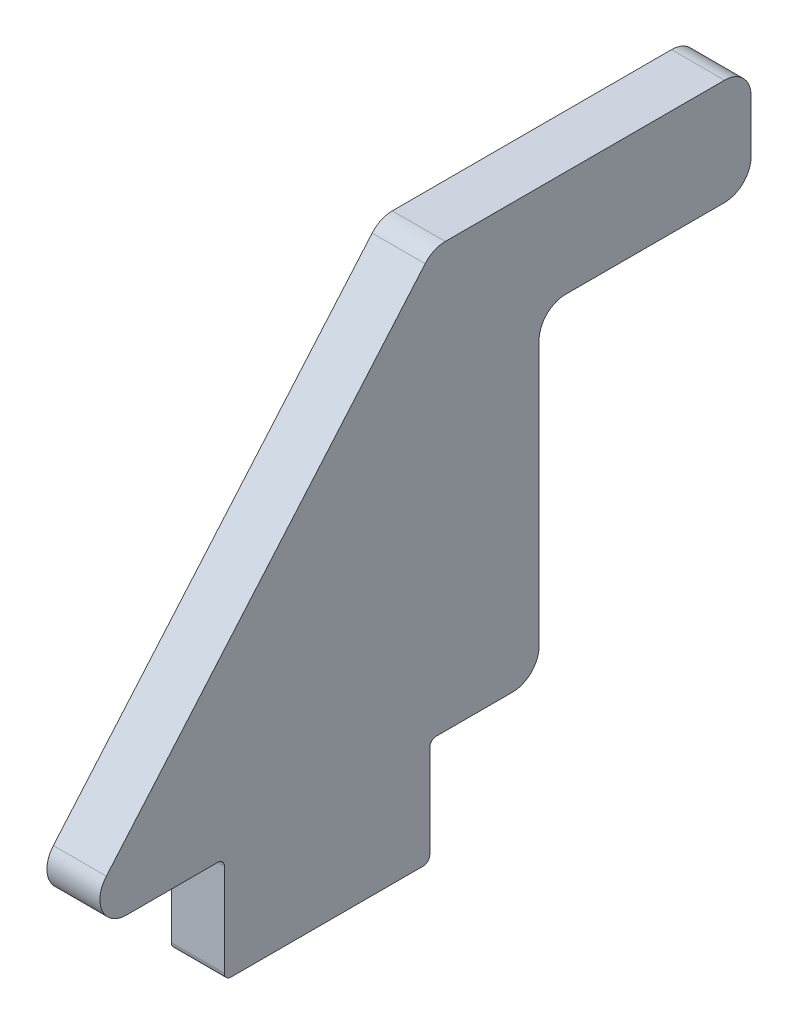
ISO-10303-21;
HEADER;
FILE_DESCRIPTION(('STEP AP214'),'2;1');
FILE_NAME('part.step','',(''),(''),'','','');
FILE_SCHEMA(('AUTOMOTIVE_DESIGN { 1 0 10303 214 1 1 1 1 }'));
ENDSEC;
DATA;
#1=APPLICATION_CONTEXT('core data for automotive mechanical design processes');
#2=APPLICATION_PROTOCOL_DEFINITION('international standard','automotive_design',2000,#1);
#3=PRODUCT_CONTEXT('',#1,'mechanical');
#4=PRODUCT('Part','Part','',(#3));
#5=PRODUCT_RELATED_PRODUCT_CATEGORY('part','',(#4));
#6=PRODUCT_DEFINITION_FORMATION('','',#4);
#7=PRODUCT_DEFINITION_CONTEXT('part definition',#1,'design');
#8=PRODUCT_DEFINITION('design','',#6,#7);
#9=PRODUCT_DEFINITION_SHAPE('','',#8);
#10=(LENGTH_UNIT() NAMED_UNIT(*) SI_UNIT(.MILLI.,.METRE.));
#11=(NAMED_UNIT(*) PLANE_ANGLE_UNIT() SI_UNIT($,.RADIAN.));
#12=(NAMED_UNIT(*) SI_UNIT($,.STERADIAN.) SOLID_ANGLE_UNIT());
#13=UNCERTAINTY_MEASURE_WITH_UNIT(LENGTH_MEASURE(1.E-05),#10,'distance_accuracy_value','');
#14=(GEOMETRIC_REPRESENTATION_CONTEXT(3) GLOBAL_UNCERTAINTY_ASSIGNED_CONTEXT((#13)) GLOBAL_UNIT_ASSIGNED_CONTEXT((#10,
#11,#12)) REPRESENTATION_CONTEXT('',''));
#15=CARTESIAN_POINT('',(0.,0.,0.));
#16=DIRECTION('',(0.,0.,1.));
#17=DIRECTION('',(1.,0.,0.));
#18=AXIS2_PLACEMENT_3D('',#15,#16,#17);
#19=CARTESIAN_POINT('',(-6.35,0.,37.703125));
#20=DIRECTION('',(0.,-1.,0.));
#21=DIRECTION('',(0.,0.,-1.));
#22=AXIS2_PLACEMENT_3D('',#19,#20,#21);
#23=PLANE('',#22);
#24=DIRECTION('',(0.,0.,-1.));
#25=VECTOR('',#24,1.);
#26=CARTESIAN_POINT('',(-6.35,0.,37.703125));
#27=LINE('',#26,#25);
#28=CARTESIAN_POINT('',(-6.35,0.,49.4413967732448));
#29=VERTEX_POINT('',#28);
#30=CARTESIAN_POINT('',(-6.35,0.,38.496875));
#31=VERTEX_POINT('',#30);
#32=EDGE_CURVE('E464',#29,#31,#27,.T.);
#33=ORIENTED_EDGE('',*,*,#32,.T.);
#34=DIRECTION('',(1.,0.,0.));
#35=VECTOR('',#34,1.);
#36=CARTESIAN_POINT('',(0.,0.,38.496875));
#37=LINE('',#36,#35);
#38=CARTESIAN_POINT('',(0.,0.,38.496875));
#39=VERTEX_POINT('',#38);
#40=EDGE_CURVE('E328',#31,#39,#37,.T.);
#41=ORIENTED_EDGE('',*,*,#40,.T.);
#42=DIRECTION('',(0.,0.,-1.));
#43=VECTOR('',#42,1.);
#44=CARTESIAN_POINT('',(0.,0.,37.703125));
#45=LINE('',#44,#43);
#46=CARTESIAN_POINT('',(0.,0.,49.4413967732448));
#47=VERTEX_POINT('',#46);
#48=EDGE_CURVE('E416',#47,#39,#45,.T.);
#49=ORIENTED_EDGE('',*,*,#48,.F.);
#50=DIRECTION('',(1.,0.,0.));
#51=VECTOR('',#50,1.);
#52=CARTESIAN_POINT('',(-6.35,0.,49.4413967732448));
#53=LINE('',#52,#51);
#54=EDGE_CURVE('E320',#47,#29,#53,.F.);
#55=ORIENTED_EDGE('',*,*,#54,.T.);
#56=EDGE_LOOP('',(#33,#41,#49,#55));
#57=FACE_BOUND('',#56,.T.);
#58=ADVANCED_FACE('F53',(#57),#23,.T.);
#59=CARTESIAN_POINT('',(-6.35,0.,56.35625));
#60=DIRECTION('',(0.,0.651766743287986,0.758419483098748));
#61=DIRECTION('',(0.,-0.758419483098748,0.651766743287986));
#62=AXIS2_PLACEMENT_3D('',#59,#60,#61);
#63=PLANE('',#62);
#64=DIRECTION('',(0.,-0.758419483098748,0.651766743287986));
#65=VECTOR('',#64,1.);
#66=CARTESIAN_POINT('',(0.,0.,56.35625));
#67=LINE('',#66,#65);
#68=CARTESIAN_POINT('',(0.,49.6943594099394,13.6501598820834));
#69=VERTEX_POINT('',#68);
#70=CARTESIAN_POINT('',(0.,5.24435940993935,51.8493786320834));
#71=VERTEX_POINT('',#70);
#72=EDGE_CURVE('E259',#69,#71,#67,.T.);
#73=ORIENTED_EDGE('',*,*,#72,.F.);
#74=DIRECTION('',(1.,0.,0.));
#75=VECTOR('',#74,1.);
#76=CARTESIAN_POINT('',(-6.35,49.6943594099394,13.6501598820834));
#77=LINE('',#76,#75);
#78=CARTESIAN_POINT('',(-6.35,49.6943594099394,13.6501598820834));
#79=VERTEX_POINT('',#78);
#80=EDGE_CURVE('E286',#69,#79,#77,.F.);
#81=ORIENTED_EDGE('',*,*,#80,.T.);
#82=DIRECTION('',(0.,-0.758419483098748,0.651766743287986));
#83=VECTOR('',#82,1.);
#84=CARTESIAN_POINT('',(-6.35,0.,56.35625));
#85=LINE('',#84,#83);
#86=CARTESIAN_POINT('',(-6.35,5.24435940993935,51.8493786320834));
#87=VERTEX_POINT('',#86);
#88=EDGE_CURVE('E264',#79,#87,#85,.T.);
#89=ORIENTED_EDGE('',*,*,#88,.T.);
#90=DIRECTION('',(1.,0.,0.));
#91=VECTOR('',#90,1.);
#92=CARTESIAN_POINT('',(-6.35,5.24435940993935,51.8493786320834));
#93=LINE('',#92,#91);
#94=EDGE_CURVE('E283',#87,#71,#93,.T.);
#95=ORIENTED_EDGE('',*,*,#94,.T.);
#96=EDGE_LOOP('',(#73,#81,#89,#95));
#97=FACE_BOUND('',#96,.T.);
#98=ADVANCED_FACE('F486',(#97),#63,.T.);
#99=CARTESIAN_POINT('',(-6.35,50.8,12.7));
#100=DIRECTION('',(0.,1.,0.));
#101=DIRECTION('',(0.,0.,1.));
#102=AXIS2_PLACEMENT_3D('',#99,#100,#101);
#103=PLANE('',#102);
#104=DIRECTION('',(0.,0.,1.));
#105=VECTOR('',#104,1.);
#106=CARTESIAN_POINT('',(-6.35,50.8,12.7));
#107=LINE('',#106,#105);
#108=CARTESIAN_POINT('',(-6.35,50.8,-22.225));
#109=VERTEX_POINT('',#108);
#110=CARTESIAN_POINT('',(-6.35,50.8,11.2421780232448));
#111=VERTEX_POINT('',#110);
#112=EDGE_CURVE('E269',#109,#111,#107,.T.);
#113=ORIENTED_EDGE('',*,*,#112,.T.);
#114=DIRECTION('',(1.,0.,0.));
#115=VECTOR('',#114,1.);
#116=CARTESIAN_POINT('',(-6.35,50.8,11.2421780232448));
#117=LINE('',#116,#115);
#118=CARTESIAN_POINT('',(0.,50.8,11.2421780232448));
#119=VERTEX_POINT('',#118);
#120=EDGE_CURVE('E257',#111,#119,#117,.T.);
#121=ORIENTED_EDGE('',*,*,#120,.T.);
#122=DIRECTION('',(0.,0.,1.));
#123=VECTOR('',#122,1.);
#124=CARTESIAN_POINT('',(0.,50.8,12.7));
#125=LINE('',#124,#123);
#126=CARTESIAN_POINT('',(0.,50.8,-22.225));
#127=VERTEX_POINT('',#126);
#128=EDGE_CURVE('E239',#127,#119,#125,.T.);
#129=ORIENTED_EDGE('',*,*,#128,.F.);
#130=DIRECTION('',(1.,0.,0.));
#131=VECTOR('',#130,1.);
#132=CARTESIAN_POINT('',(-6.35,50.8,-22.225));
#133=LINE('',#132,#131);
#134=EDGE_CURVE('E254',#127,#109,#133,.F.);
#135=ORIENTED_EDGE('',*,*,#134,.T.);
#136=EDGE_LOOP('',(#113,#121,#129,#135));
#137=FACE_BOUND('',#136,.T.);
#138=ADVANCED_FACE('F253',(#137),#103,.T.);
#139=CARTESIAN_POINT('',(-6.35,50.8,-25.4));
#140=DIRECTION('',(0.,0.,-1.));
#141=DIRECTION('',(-1.,0.,0.));
#142=AXIS2_PLACEMENT_3D('',#139,#140,#141);
#143=PLANE('',#142);
#144=DIRECTION('',(0.,1.,0.));
#145=VECTOR('',#144,1.);
#146=CARTESIAN_POINT('',(0.,50.8,-25.4));
#147=LINE('',#146,#145);
#148=CARTESIAN_POINT('',(0.,41.275,-25.4));
#149=VERTEX_POINT('',#148);
#150=CARTESIAN_POINT('',(0.,47.625,-25.4));
#151=VERTEX_POINT('',#150);
#152=EDGE_CURVE('E241',#149,#151,#147,.T.);
#153=ORIENTED_EDGE('',*,*,#152,.F.);
#154=DIRECTION('',(1.,0.,0.));
#155=VECTOR('',#154,1.);
#156=CARTESIAN_POINT('',(-6.35,41.275,-25.4));
#157=LINE('',#156,#155);
#158=CARTESIAN_POINT('',(-6.35,41.275,-25.4));
#159=VERTEX_POINT('',#158);
#160=EDGE_CURVE('E318',#149,#159,#157,.F.);
#161=ORIENTED_EDGE('',*,*,#160,.T.);
#162=DIRECTION('',(0.,1.,0.));
#163=VECTOR('',#162,1.);
#164=CARTESIAN_POINT('',(-6.35,50.8,-25.4));
#165=LINE('',#164,#163);
#166=CARTESIAN_POINT('',(-6.35,47.625,-25.4));
#167=VERTEX_POINT('',#166);
#168=EDGE_CURVE('E410',#159,#167,#165,.T.);
#169=ORIENTED_EDGE('',*,*,#168,.T.);
#170=DIRECTION('',(1.,0.,0.));
#171=VECTOR('',#170,1.);
#172=CARTESIAN_POINT('',(-6.35,47.625,-25.4));
#173=LINE('',#172,#171);
#174=EDGE_CURVE('E316',#167,#151,#173,.T.);
#175=ORIENTED_EDGE('',*,*,#174,.T.);
#176=EDGE_LOOP('',(#153,#161,#169,#175));
#177=FACE_BOUND('',#176,.T.);
#178=ADVANCED_FACE('F686',(#177),#143,.T.);
#179=CARTESIAN_POINT('',(-6.35,38.1,-25.4));
#180=DIRECTION('',(0.,-1.,0.));
#181=DIRECTION('',(0.,0.,-1.));
#182=AXIS2_PLACEMENT_3D('',#179,#180,#181);
#183=PLANE('',#182);
#184=DIRECTION('',(0.,0.,-1.));
#185=VECTOR('',#184,1.);
#186=CARTESIAN_POINT('',(0.,38.1,-25.4));
#187=LINE('',#186,#185);
#188=CARTESIAN_POINT('',(0.,38.1,-3.175));
#189=VERTEX_POINT('',#188);
#190=CARTESIAN_POINT('',(0.,38.1,-22.225));
#191=VERTEX_POINT('',#190);
#192=EDGE_CURVE('E431',#189,#191,#187,.T.);
#193=ORIENTED_EDGE('',*,*,#192,.F.);
#194=DIRECTION('',(1.,0.,0.));
#195=VECTOR('',#194,1.);
#196=CARTESIAN_POINT('',(-6.35,38.1,-3.17500000000001));
#197=LINE('',#196,#195);
#198=CARTESIAN_POINT('',(-6.35,38.1,-3.175));
#199=VERTEX_POINT('',#198);
#200=EDGE_CURVE('E314',#189,#199,#197,.F.);
#201=ORIENTED_EDGE('',*,*,#200,.T.);
#202=DIRECTION('',(0.,0.,-1.));
#203=VECTOR('',#202,1.);
#204=CARTESIAN_POINT('',(-6.35,38.1,-25.4));
#205=LINE('',#204,#203);
#206=CARTESIAN_POINT('',(-6.35,38.1,-22.225));
#207=VERTEX_POINT('',#206);
#208=EDGE_CURVE('E406',#199,#207,#205,.T.);
#209=ORIENTED_EDGE('',*,*,#208,.T.);
#210=DIRECTION('',(1.,0.,0.));
#211=VECTOR('',#210,1.);
#212=CARTESIAN_POINT('',(-6.35,38.1,-22.225));
#213=LINE('',#212,#211);
#214=EDGE_CURVE('E311',#207,#191,#213,.T.);
#215=ORIENTED_EDGE('',*,*,#214,.T.);
#216=EDGE_LOOP('',(#193,#201,#209,#215));
#217=FACE_BOUND('',#216,.T.);
#218=ADVANCED_FACE('F675',(#217),#183,.T.);
#219=CARTESIAN_POINT('',(-6.35,38.1,0.));
#220=DIRECTION('',(0.,0.,-1.));
#221=DIRECTION('',(0.,1.,0.));
#222=AXIS2_PLACEMENT_3D('',#219,#220,#221);
#223=PLANE('',#222);
#224=DIRECTION('',(0.,1.,0.));
#225=VECTOR('',#224,1.);
#226=CARTESIAN_POINT('',(0.,38.1,0.));
#227=LINE('',#226,#225);
#228=CARTESIAN_POINT('',(0.,3.175,0.));
#229=VERTEX_POINT('',#228);
#230=CARTESIAN_POINT('',(0.,34.925,0.));
#231=VERTEX_POINT('',#230);
#232=EDGE_CURVE('E380',#229,#231,#227,.T.);
#233=ORIENTED_EDGE('',*,*,#232,.F.);
#234=DIRECTION('',(1.,0.,0.));
#235=VECTOR('',#234,1.);
#236=CARTESIAN_POINT('',(-6.35,3.175,0.));
#237=LINE('',#236,#235);
#238=CARTESIAN_POINT('',(-6.35,3.175,0.));
#239=VERTEX_POINT('',#238);
#240=EDGE_CURVE('E309',#229,#239,#237,.F.);
#241=ORIENTED_EDGE('',*,*,#240,.T.);
#242=DIRECTION('',(0.,1.,0.));
#243=VECTOR('',#242,1.);
#244=CARTESIAN_POINT('',(-6.35,38.1,0.));
#245=LINE('',#244,#243);
#246=CARTESIAN_POINT('',(-6.35,34.925,0.));
#247=VERTEX_POINT('',#246);
#248=EDGE_CURVE('E396',#239,#247,#245,.T.);
#249=ORIENTED_EDGE('',*,*,#248,.T.);
#250=DIRECTION('',(1.,0.,0.));
#251=VECTOR('',#250,1.);
#252=CARTESIAN_POINT('',(0.,34.925,0.));
#253=LINE('',#252,#251);
#254=EDGE_CURVE('E306',#247,#231,#253,.T.);
#255=ORIENTED_EDGE('',*,*,#254,.T.);
#256=EDGE_LOOP('',(#233,#241,#249,#255));
#257=FACE_BOUND('',#256,.T.);
#258=ADVANCED_FACE('F575',(#257),#223,.T.);
#259=CARTESIAN_POINT('',(-6.35,0.,0.));
#260=DIRECTION('',(0.,-1.,0.));
#261=DIRECTION('',(0.,0.,-1.));
#262=AXIS2_PLACEMENT_3D('',#259,#260,#261);
#263=PLANE('',#262);
#264=DIRECTION('',(0.,0.,-1.));
#265=VECTOR('',#264,1.);
#266=CARTESIAN_POINT('',(0.,0.,0.));
#267=LINE('',#266,#265);
#268=CARTESIAN_POINT('',(0.,0.,12.303125));
#269=VERTEX_POINT('',#268);
#270=CARTESIAN_POINT('',(0.,0.,3.175));
#271=VERTEX_POINT('',#270);
#272=EDGE_CURVE('E368',#269,#271,#267,.T.);
#273=ORIENTED_EDGE('',*,*,#272,.F.);
#274=DIRECTION('',(1.,0.,0.));
#275=VECTOR('',#274,1.);
#276=CARTESIAN_POINT('',(-6.35,0.,12.303125));
#277=LINE('',#276,#275);
#278=CARTESIAN_POINT('',(-6.35,0.,12.303125));
#279=VERTEX_POINT('',#278);
#280=EDGE_CURVE('E341',#269,#279,#277,.F.);
#281=ORIENTED_EDGE('',*,*,#280,.T.);
#282=DIRECTION('',(0.,0.,-1.));
#283=VECTOR('',#282,1.);
#284=CARTESIAN_POINT('',(-6.35,0.,0.));
#285=LINE('',#284,#283);
#286=CARTESIAN_POINT('',(-6.35,0.,3.175));
#287=VERTEX_POINT('',#286);
#288=EDGE_CURVE('E387',#279,#287,#285,.T.);
#289=ORIENTED_EDGE('',*,*,#288,.T.);
#290=DIRECTION('',(1.,0.,0.));
#291=VECTOR('',#290,1.);
#292=CARTESIAN_POINT('',(-6.35,0.,3.175));
#293=LINE('',#292,#291);
#294=EDGE_CURVE('E303',#287,#271,#293,.T.);
#295=ORIENTED_EDGE('',*,*,#294,.T.);
#296=EDGE_LOOP('',(#273,#281,#289,#295));
#297=FACE_BOUND('',#296,.T.);
#298=ADVANCED_FACE('F376',(#297),#263,.T.);
#299=CARTESIAN_POINT('',(-6.35,0.,13.096875));
#300=DIRECTION('',(0.,0.,-1.));
#301=DIRECTION('',(0.,1.,0.));
#302=AXIS2_PLACEMENT_3D('',#299,#300,#301);
#303=PLANE('',#302);
#304=DIRECTION('',(0.,1.,0.));
#305=VECTOR('',#304,1.);
#306=CARTESIAN_POINT('',(-6.35,0.,13.096875));
#307=LINE('',#306,#305);
#308=CARTESIAN_POINT('',(-6.35,-11.90625,13.096875));
#309=VERTEX_POINT('',#308);
#310=CARTESIAN_POINT('',(-6.35,-0.793750000000002,13.096875));
#311=VERTEX_POINT('',#310);
#312=EDGE_CURVE('E386',#309,#311,#307,.T.);
#313=ORIENTED_EDGE('',*,*,#312,.T.);
#314=DIRECTION('',(1.,0.,0.));
#315=VECTOR('',#314,1.);
#316=CARTESIAN_POINT('',(0.,-0.793750000000002,13.096875));
#317=LINE('',#316,#315);
#318=CARTESIAN_POINT('',(0.,-0.793750000000002,13.096875));
#319=VERTEX_POINT('',#318);
#320=EDGE_CURVE('E338',#311,#319,#317,.T.);
#321=ORIENTED_EDGE('',*,*,#320,.T.);
#322=DIRECTION('',(0.,1.,0.));
#323=VECTOR('',#322,1.);
#324=CARTESIAN_POINT('',(0.,0.,13.096875));
#325=LINE('',#324,#323);
#326=CARTESIAN_POINT('',(0.,-11.90625,13.096875));
#327=VERTEX_POINT('',#326);
#328=EDGE_CURVE('E371',#327,#319,#325,.T.);
#329=ORIENTED_EDGE('',*,*,#328,.F.);
#330=DIRECTION('',(1.,0.,0.));
#331=VECTOR('',#330,1.);
#332=CARTESIAN_POINT('',(-6.35,-11.90625,13.096875));
#333=LINE('',#332,#331);
#334=EDGE_CURVE('E336',#327,#309,#333,.F.);
#335=ORIENTED_EDGE('',*,*,#334,.T.);
#336=EDGE_LOOP('',(#313,#321,#329,#335));
#337=FACE_BOUND('',#336,.T.);
#338=ADVANCED_FACE('F389',(#337),#303,.T.);
#339=CARTESIAN_POINT('',(-6.35,-12.7,13.096875));
#340=DIRECTION('',(0.,-1.,0.));
#341=DIRECTION('',(0.,0.,-1.));
#342=AXIS2_PLACEMENT_3D('',#339,#340,#341);
#343=PLANE('',#342);
#344=DIRECTION('',(0.,0.,-1.));
#345=VECTOR('',#344,1.);
#346=CARTESIAN_POINT('',(-6.35,-12.7,13.096875));
#347=LINE('',#346,#345);
#348=CARTESIAN_POINT('',(-6.35,-12.7,36.909375));
#349=VERTEX_POINT('',#348);
#350=CARTESIAN_POINT('',(-6.35,-12.7,13.890625));
#351=VERTEX_POINT('',#350);
#352=EDGE_CURVE('E391',#349,#351,#347,.T.);
#353=ORIENTED_EDGE('',*,*,#352,.T.);
#354=DIRECTION('',(1.,0.,0.));
#355=VECTOR('',#354,1.);
#356=CARTESIAN_POINT('',(-6.35,-12.7,13.890625));
#357=LINE('',#356,#355);
#358=CARTESIAN_POINT('',(0.,-12.7,13.890625));
#359=VERTEX_POINT('',#358);
#360=EDGE_CURVE('E344',#351,#359,#357,.T.);
#361=ORIENTED_EDGE('',*,*,#360,.T.);
#362=DIRECTION('',(0.,0.,-1.));
#363=VECTOR('',#362,1.);
#364=CARTESIAN_POINT('',(0.,-12.7,13.096875));
#365=LINE('',#364,#363);
#366=CARTESIAN_POINT('',(0.,-12.7,36.909375));
#367=VERTEX_POINT('',#366);
#368=EDGE_CURVE('E424',#367,#359,#365,.T.);
#369=ORIENTED_EDGE('',*,*,#368,.F.);
#370=DIRECTION('',(1.,0.,0.));
#371=VECTOR('',#370,1.);
#372=CARTESIAN_POINT('',(-6.35,-12.7,36.909375));
#373=LINE('',#372,#371);
#374=EDGE_CURVE('E82',#367,#349,#373,.F.);
#375=ORIENTED_EDGE('',*,*,#374,.T.);
#376=EDGE_LOOP('',(#353,#361,#369,#375));
#377=FACE_BOUND('',#376,.T.);
#378=ADVANCED_FACE('F510',(#377),#343,.T.);
#379=CARTESIAN_POINT('',(-6.35,-12.7,37.703125));
#380=DIRECTION('',(0.,0.,1.));
#381=DIRECTION('',(1.,0.,0.));
#382=AXIS2_PLACEMENT_3D('',#379,#380,#381);
#383=PLANE('',#382);
#384=DIRECTION('',(0.,-1.,0.));
#385=VECTOR('',#384,1.);
#386=CARTESIAN_POINT('',(0.,-12.7,37.703125));
#387=LINE('',#386,#385);
#388=CARTESIAN_POINT('',(0.,-0.793750000000005,37.703125));
#389=VERTEX_POINT('',#388);
#390=CARTESIAN_POINT('',(0.,-11.90625,37.703125));
#391=VERTEX_POINT('',#390);
#392=EDGE_CURVE('E420',#389,#391,#387,.T.);
#393=ORIENTED_EDGE('',*,*,#392,.F.);
#394=DIRECTION('',(1.,0.,0.));
#395=VECTOR('',#394,1.);
#396=CARTESIAN_POINT('',(-6.35,-0.793750000000005,37.703125));
#397=LINE('',#396,#395);
#398=CARTESIAN_POINT('',(-6.35,-0.793750000000005,37.703125));
#399=VERTEX_POINT('',#398);
#400=EDGE_CURVE('E334',#389,#399,#397,.F.);
#401=ORIENTED_EDGE('',*,*,#400,.T.);
#402=DIRECTION('',(0.,-1.,0.));
#403=VECTOR('',#402,1.);
#404=CARTESIAN_POINT('',(-6.35,-12.7,37.703125));
#405=LINE('',#404,#403);
#406=CARTESIAN_POINT('',(-6.35,-11.90625,37.703125));
#407=VERTEX_POINT('',#406);
#408=EDGE_CURVE('E399',#399,#407,#405,.T.);
#409=ORIENTED_EDGE('',*,*,#408,.T.);
#410=DIRECTION('',(1.,0.,0.));
#411=VECTOR('',#410,1.);
#412=CARTESIAN_POINT('',(-6.35,-11.90625,37.703125));
#413=LINE('',#412,#411);
#414=EDGE_CURVE('E331',#407,#391,#413,.T.);
#415=ORIENTED_EDGE('',*,*,#414,.T.);
#416=EDGE_LOOP('',(#393,#401,#409,#415));
#417=FACE_BOUND('',#416,.T.);
#418=ADVANCED_FACE('F506',(#417),#383,.T.);
#419=CARTESIAN_POINT('',(-6.35,0.,0.));
#420=DIRECTION('',(1.,0.,0.));
#421=DIRECTION('',(0.,0.,-1.));
#422=AXIS2_PLACEMENT_3D('',#419,#420,#421);
#423=PLANE('',#422);
#424=ORIENTED_EDGE('',*,*,#312,.F.);
#425=CARTESIAN_POINT('',(-6.35,-11.90625,13.890625));
#426=DIRECTION('',(1.,0.,0.));
#427=DIRECTION('',(0.,0.,-1.));
#428=AXIS2_PLACEMENT_3D('',#425,#426,#427);
#429=CIRCLE('',#428,0.79375);
#430=EDGE_CURVE('E73',#309,#351,#429,.F.);
#431=ORIENTED_EDGE('',*,*,#430,.T.);
#432=ORIENTED_EDGE('',*,*,#352,.F.);
#433=CARTESIAN_POINT('',(-6.35,-11.90625,36.909375));
#434=DIRECTION('',(1.,0.,0.));
#435=DIRECTION('',(0.,0.,-1.));
#436=AXIS2_PLACEMENT_3D('',#433,#434,#435);
#437=CIRCLE('',#436,0.79375);
#438=EDGE_CURVE('E353',#349,#407,#437,.F.);
#439=ORIENTED_EDGE('',*,*,#438,.T.);
#440=ORIENTED_EDGE('',*,*,#408,.F.);
#441=CARTESIAN_POINT('',(-6.35,-0.793750000000005,38.496875));
#442=DIRECTION('',(1.,0.,0.));
#443=DIRECTION('',(0.,0.,-1.));
#444=AXIS2_PLACEMENT_3D('',#441,#442,#443);
#445=CIRCLE('',#444,0.79375);
#446=EDGE_CURVE('E361',#399,#31,#445,.T.);
#447=ORIENTED_EDGE('',*,*,#446,.T.);
#448=ORIENTED_EDGE('',*,*,#32,.F.);
#449=CARTESIAN_POINT('',(-6.35,3.17499999999999,49.4413967732448));
#450=DIRECTION('',(1.,0.,0.));
#451=DIRECTION('',(0.,0.,-1.));
#452=AXIS2_PLACEMENT_3D('',#449,#450,#451);
#453=CIRCLE('',#452,3.175);
#454=EDGE_CURVE('E288',#29,#87,#453,.F.);
#455=ORIENTED_EDGE('',*,*,#454,.T.);
#456=ORIENTED_EDGE('',*,*,#88,.F.);
#457=CARTESIAN_POINT('',(-6.35,47.625,11.2421780232448));
#458=DIRECTION('',(1.,0.,0.));
#459=DIRECTION('',(0.,0.,-1.));
#460=AXIS2_PLACEMENT_3D('',#457,#458,#459);
#461=CIRCLE('',#460,3.175);
#462=EDGE_CURVE('E300',#79,#111,#461,.F.);
#463=ORIENTED_EDGE('',*,*,#462,.T.);
#464=ORIENTED_EDGE('',*,*,#112,.F.);
#465=CARTESIAN_POINT('',(-6.35,47.625,-22.225));
#466=DIRECTION('',(1.,0.,0.));
#467=DIRECTION('',(0.,0.,-1.));
#468=AXIS2_PLACEMENT_3D('',#465,#466,#467);
#469=CIRCLE('',#468,3.175);
#470=EDGE_CURVE('E263',#109,#167,#469,.F.);
#471=ORIENTED_EDGE('',*,*,#470,.T.);
#472=ORIENTED_EDGE('',*,*,#168,.F.);
#473=CARTESIAN_POINT('',(-6.35,41.275,-22.225));
#474=DIRECTION('',(1.,0.,0.));
#475=DIRECTION('',(0.,0.,-1.));
#476=AXIS2_PLACEMENT_3D('',#473,#474,#475);
#477=CIRCLE('',#476,3.175);
#478=EDGE_CURVE('E293',#159,#207,#477,.F.);
#479=ORIENTED_EDGE('',*,*,#478,.T.);
#480=ORIENTED_EDGE('',*,*,#208,.F.);
#481=CARTESIAN_POINT('',(-6.35,34.925,-3.17500000000001));
#482=DIRECTION('',(1.,0.,0.));
#483=DIRECTION('',(0.,0.,-1.));
#484=AXIS2_PLACEMENT_3D('',#481,#482,#483);
#485=CIRCLE('',#484,3.175);
#486=EDGE_CURVE('E325',#199,#247,#485,.T.);
#487=ORIENTED_EDGE('',*,*,#486,.T.);
#488=ORIENTED_EDGE('',*,*,#248,.F.);
#489=CARTESIAN_POINT('',(-6.35,3.175,3.175));
#490=DIRECTION('',(1.,0.,0.));
#491=DIRECTION('',(0.,0.,-1.));
#492=AXIS2_PLACEMENT_3D('',#489,#490,#491);
#493=CIRCLE('',#492,3.175);
#494=EDGE_CURVE('E296',#239,#287,#493,.F.);
#495=ORIENTED_EDGE('',*,*,#494,.T.);
#496=ORIENTED_EDGE('',*,*,#288,.F.);
#497=CARTESIAN_POINT('',(-6.35,-0.793750000000002,12.303125));
#498=DIRECTION('',(1.,0.,0.));
#499=DIRECTION('',(0.,0.,-1.));
#500=AXIS2_PLACEMENT_3D('',#497,#498,#499);
#501=CIRCLE('',#500,0.79375);
#502=EDGE_CURVE('E11',#279,#311,#501,.T.);
#503=ORIENTED_EDGE('',*,*,#502,.T.);
#504=EDGE_LOOP('',(#424,#431,#432,#439,#440,#447,#448,#455,#456,#463,#464,#471,#472,#479,#480,
#487,#488,#495,#496,#503));
#505=FACE_BOUND('',#504,.T.);
#506=ADVANCED_FACE('F385',(#505),#423,.F.);
#507=CARTESIAN_POINT('',(0.,0.,0.));
#508=DIRECTION('',(1.,0.,0.));
#509=DIRECTION('',(0.,0.,-1.));
#510=AXIS2_PLACEMENT_3D('',#507,#508,#509);
#511=PLANE('',#510);
#512=ORIENTED_EDGE('',*,*,#368,.T.);
#513=CARTESIAN_POINT('',(0.,-11.90625,13.890625));
#514=DIRECTION('',(1.,0.,0.));
#515=DIRECTION('',(0.,0.,-1.));
#516=AXIS2_PLACEMENT_3D('',#513,#514,#515);
#517=CIRCLE('',#516,0.79375);
#518=EDGE_CURVE('E350',#359,#327,#517,.T.);
#519=ORIENTED_EDGE('',*,*,#518,.T.);
#520=ORIENTED_EDGE('',*,*,#328,.T.);
#521=CARTESIAN_POINT('',(0.,-0.793750000000002,12.303125));
#522=DIRECTION('',(1.,0.,0.));
#523=DIRECTION('',(0.,0.,-1.));
#524=AXIS2_PLACEMENT_3D('',#521,#522,#523);
#525=CIRCLE('',#524,0.79375);
#526=EDGE_CURVE('E62',#319,#269,#525,.F.);
#527=ORIENTED_EDGE('',*,*,#526,.T.);
#528=ORIENTED_EDGE('',*,*,#272,.T.);
#529=CARTESIAN_POINT('',(0.,3.175,3.175));
#530=DIRECTION('',(1.,0.,0.));
#531=DIRECTION('',(0.,0.,-1.));
#532=AXIS2_PLACEMENT_3D('',#529,#530,#531);
#533=CIRCLE('',#532,3.175);
#534=EDGE_CURVE('E277',#271,#229,#533,.T.);
#535=ORIENTED_EDGE('',*,*,#534,.T.);
#536=ORIENTED_EDGE('',*,*,#232,.T.);
#537=CARTESIAN_POINT('',(0.,34.925,-3.17500000000001));
#538=DIRECTION('',(1.,0.,0.));
#539=DIRECTION('',(0.,0.,-1.));
#540=AXIS2_PLACEMENT_3D('',#537,#538,#539);
#541=CIRCLE('',#540,3.175);
#542=EDGE_CURVE('E322',#231,#189,#541,.F.);
#543=ORIENTED_EDGE('',*,*,#542,.T.);
#544=ORIENTED_EDGE('',*,*,#192,.T.);
#545=CARTESIAN_POINT('',(0.,41.275,-22.225));
#546=DIRECTION('',(1.,0.,0.));
#547=DIRECTION('',(0.,0.,-1.));
#548=AXIS2_PLACEMENT_3D('',#545,#546,#547);
#549=CIRCLE('',#548,3.175);
#550=EDGE_CURVE('E247',#191,#149,#549,.T.);
#551=ORIENTED_EDGE('',*,*,#550,.T.);
#552=ORIENTED_EDGE('',*,*,#152,.T.);
#553=CARTESIAN_POINT('',(0.,47.625,-22.225));
#554=DIRECTION('',(1.,0.,0.));
#555=DIRECTION('',(0.,0.,-1.));
#556=AXIS2_PLACEMENT_3D('',#553,#554,#555);
#557=CIRCLE('',#556,3.175);
#558=EDGE_CURVE('E235',#151,#127,#557,.T.);
#559=ORIENTED_EDGE('',*,*,#558,.T.);
#560=ORIENTED_EDGE('',*,*,#128,.T.);
#561=CARTESIAN_POINT('',(0.,47.625,11.2421780232448));
#562=DIRECTION('',(1.,0.,0.));
#563=DIRECTION('',(0.,0.,-1.));
#564=AXIS2_PLACEMENT_3D('',#561,#562,#563);
#565=CIRCLE('',#564,3.175);
#566=EDGE_CURVE('E280',#119,#69,#565,.T.);
#567=ORIENTED_EDGE('',*,*,#566,.T.);
#568=ORIENTED_EDGE('',*,*,#72,.T.);
#569=CARTESIAN_POINT('',(0.,3.17499999999999,49.4413967732448));
#570=DIRECTION('',(1.,0.,0.));
#571=DIRECTION('',(0.,0.,-1.));
#572=AXIS2_PLACEMENT_3D('',#569,#570,#571);
#573=CIRCLE('',#572,3.175);
#574=EDGE_CURVE('E248',#71,#47,#573,.T.);
#575=ORIENTED_EDGE('',*,*,#574,.T.);
#576=ORIENTED_EDGE('',*,*,#48,.T.);
#577=CARTESIAN_POINT('',(0.,-0.793750000000005,38.496875));
#578=DIRECTION('',(1.,0.,0.));
#579=DIRECTION('',(0.,0.,-1.));
#580=AXIS2_PLACEMENT_3D('',#577,#578,#579);
#581=CIRCLE('',#580,0.79375);
#582=EDGE_CURVE('E358',#39,#389,#581,.F.);
#583=ORIENTED_EDGE('',*,*,#582,.T.);
#584=ORIENTED_EDGE('',*,*,#392,.T.);
#585=CARTESIAN_POINT('',(0.,-11.90625,36.909375));
#586=DIRECTION('',(1.,0.,0.));
#587=DIRECTION('',(0.,0.,-1.));
#588=AXIS2_PLACEMENT_3D('',#585,#586,#587);
#589=CIRCLE('',#588,0.79375);
#590=EDGE_CURVE('E347',#391,#367,#589,.T.);
#591=ORIENTED_EDGE('',*,*,#590,.T.);
#592=EDGE_LOOP('',(#512,#519,#520,#527,#528,#535,#536,#543,#544,#551,#552,#559,#560,#567,#568,
#575,#576,#583,#584,#591));
#593=FACE_BOUND('',#592,.T.);
#594=ADVANCED_FACE('F238',(#593),#511,.T.);
#595=CARTESIAN_POINT('',(-6.35,47.625,11.2421780232448));
#596=DIRECTION('',(1.,0.,0.));
#597=DIRECTION('',(0.,0.,-1.));
#598=AXIS2_PLACEMENT_3D('',#595,#596,#597);
#599=CYLINDRICAL_SURFACE('',#598,3.175);
#600=ORIENTED_EDGE('',*,*,#462,.F.);
#601=ORIENTED_EDGE('',*,*,#80,.F.);
#602=ORIENTED_EDGE('',*,*,#566,.F.);
#603=ORIENTED_EDGE('',*,*,#120,.F.);
#604=EDGE_LOOP('',(#600,#601,#602,#603));
#605=FACE_BOUND('',#604,.T.);
#606=ADVANCED_FACE('F491',(#605),#599,.T.);
#607=CARTESIAN_POINT('',(-6.35,3.175,3.175));
#608=DIRECTION('',(1.,0.,0.));
#609=DIRECTION('',(0.,0.,-1.));
#610=AXIS2_PLACEMENT_3D('',#607,#608,#609);
#611=CYLINDRICAL_SURFACE('',#610,3.175);
#612=ORIENTED_EDGE('',*,*,#494,.F.);
#613=ORIENTED_EDGE('',*,*,#240,.F.);
#614=ORIENTED_EDGE('',*,*,#534,.F.);
#615=ORIENTED_EDGE('',*,*,#294,.F.);
#616=EDGE_LOOP('',(#612,#613,#614,#615));
#617=FACE_BOUND('',#616,.T.);
#618=ADVANCED_FACE('F533',(#617),#611,.T.);
#619=CARTESIAN_POINT('',(-6.35,34.925,-3.17500000000001));
#620=DIRECTION('',(-1.,0.,0.));
#621=DIRECTION('',(0.,0.,1.));
#622=AXIS2_PLACEMENT_3D('',#619,#620,#621);
#623=CYLINDRICAL_SURFACE('',#622,3.175);
#624=ORIENTED_EDGE('',*,*,#486,.F.);
#625=ORIENTED_EDGE('',*,*,#200,.F.);
#626=ORIENTED_EDGE('',*,*,#542,.F.);
#627=ORIENTED_EDGE('',*,*,#254,.F.);
#628=EDGE_LOOP('',(#624,#625,#626,#627));
#629=FACE_BOUND('',#628,.T.);
#630=ADVANCED_FACE('F536',(#629),#623,.F.);
#631=CARTESIAN_POINT('',(-6.35,41.275,-22.225));
#632=DIRECTION('',(1.,0.,0.));
#633=DIRECTION('',(0.,0.,-1.));
#634=AXIS2_PLACEMENT_3D('',#631,#632,#633);
#635=CYLINDRICAL_SURFACE('',#634,3.175);
#636=ORIENTED_EDGE('',*,*,#478,.F.);
#637=ORIENTED_EDGE('',*,*,#160,.F.);
#638=ORIENTED_EDGE('',*,*,#550,.F.);
#639=ORIENTED_EDGE('',*,*,#214,.F.);
#640=EDGE_LOOP('',(#636,#637,#638,#639));
#641=FACE_BOUND('',#640,.T.);
#642=ADVANCED_FACE('F540',(#641),#635,.T.);
#643=CARTESIAN_POINT('',(-6.35,47.625,-22.225));
#644=DIRECTION('',(1.,0.,0.));
#645=DIRECTION('',(0.,0.,-1.));
#646=AXIS2_PLACEMENT_3D('',#643,#644,#645);
#647=CYLINDRICAL_SURFACE('',#646,3.175);
#648=ORIENTED_EDGE('',*,*,#470,.F.);
#649=ORIENTED_EDGE('',*,*,#134,.F.);
#650=ORIENTED_EDGE('',*,*,#558,.F.);
#651=ORIENTED_EDGE('',*,*,#174,.F.);
#652=EDGE_LOOP('',(#648,#649,#650,#651));
#653=FACE_BOUND('',#652,.T.);
#654=ADVANCED_FACE('F262',(#653),#647,.T.);
#655=CARTESIAN_POINT('',(-6.35,3.17499999999999,49.4413967732448));
#656=DIRECTION('',(1.,0.,0.));
#657=DIRECTION('',(0.,0.,-1.));
#658=AXIS2_PLACEMENT_3D('',#655,#656,#657);
#659=CYLINDRICAL_SURFACE('',#658,3.175);
#660=ORIENTED_EDGE('',*,*,#454,.F.);
#661=ORIENTED_EDGE('',*,*,#54,.F.);
#662=ORIENTED_EDGE('',*,*,#574,.F.);
#663=ORIENTED_EDGE('',*,*,#94,.F.);
#664=EDGE_LOOP('',(#660,#661,#662,#663));
#665=FACE_BOUND('',#664,.T.);
#666=ADVANCED_FACE('F495',(#665),#659,.T.);
#667=CARTESIAN_POINT('',(-6.35,-0.793750000000005,38.496875));
#668=DIRECTION('',(-1.,0.,0.));
#669=DIRECTION('',(0.,0.,1.));
#670=AXIS2_PLACEMENT_3D('',#667,#668,#669);
#671=CYLINDRICAL_SURFACE('',#670,0.79375);
#672=ORIENTED_EDGE('',*,*,#446,.F.);
#673=ORIENTED_EDGE('',*,*,#400,.F.);
#674=ORIENTED_EDGE('',*,*,#582,.F.);
#675=ORIENTED_EDGE('',*,*,#40,.F.);
#676=EDGE_LOOP('',(#672,#673,#674,#675));
#677=FACE_BOUND('',#676,.T.);
#678=ADVANCED_FACE('F503',(#677),#671,.F.);
#679=CARTESIAN_POINT('',(-6.35,-0.793750000000002,12.303125));
#680=DIRECTION('',(-1.,0.,0.));
#681=DIRECTION('',(0.,0.,1.));
#682=AXIS2_PLACEMENT_3D('',#679,#680,#681);
#683=CYLINDRICAL_SURFACE('',#682,0.79375);
#684=ORIENTED_EDGE('',*,*,#502,.F.);
#685=ORIENTED_EDGE('',*,*,#280,.F.);
#686=ORIENTED_EDGE('',*,*,#526,.F.);
#687=ORIENTED_EDGE('',*,*,#320,.F.);
#688=EDGE_LOOP('',(#684,#685,#686,#687));
#689=FACE_BOUND('',#688,.T.);
#690=ADVANCED_FACE('F383',(#689),#683,.F.);
#691=CARTESIAN_POINT('',(-6.35,-11.90625,13.890625));
#692=DIRECTION('',(1.,0.,0.));
#693=DIRECTION('',(0.,0.,-1.));
#694=AXIS2_PLACEMENT_3D('',#691,#692,#693);
#695=CYLINDRICAL_SURFACE('',#694,0.79375);
#696=ORIENTED_EDGE('',*,*,#430,.F.);
#697=ORIENTED_EDGE('',*,*,#334,.F.);
#698=ORIENTED_EDGE('',*,*,#518,.F.);
#699=ORIENTED_EDGE('',*,*,#360,.F.);
#700=EDGE_LOOP('',(#696,#697,#698,#699));
#701=FACE_BOUND('',#700,.T.);
#702=ADVANCED_FACE('F513',(#701),#695,.T.);
#703=CARTESIAN_POINT('',(-6.35,-11.90625,36.909375));
#704=DIRECTION('',(1.,0.,0.));
#705=DIRECTION('',(0.,0.,-1.));
#706=AXIS2_PLACEMENT_3D('',#703,#704,#705);
#707=CYLINDRICAL_SURFACE('',#706,0.79375);
#708=ORIENTED_EDGE('',*,*,#438,.F.);
#709=ORIENTED_EDGE('',*,*,#374,.F.);
#710=ORIENTED_EDGE('',*,*,#590,.F.);
#711=ORIENTED_EDGE('',*,*,#414,.F.);
#712=EDGE_LOOP('',(#708,#709,#710,#711));
#713=FACE_BOUND('',#712,.T.);
#714=ADVANCED_FACE('F55',(#713),#707,.T.);
#715=CLOSED_SHELL('',(#58,#98,#138,#178,#218,#258,#298,#338,#378,#418,#506,#594,#606,#618,#630,
#642,#654,#666,#678,#690,#702,#714));
#716=MANIFOLD_SOLID_BREP('B2',#715);
#717=ADVANCED_BREP_SHAPE_REPRESENTATION('',(#18,#716),#14);
#718=SHAPE_DEFINITION_REPRESENTATION(#9,#717);
ENDSEC;
END-ISO-10303-21;
